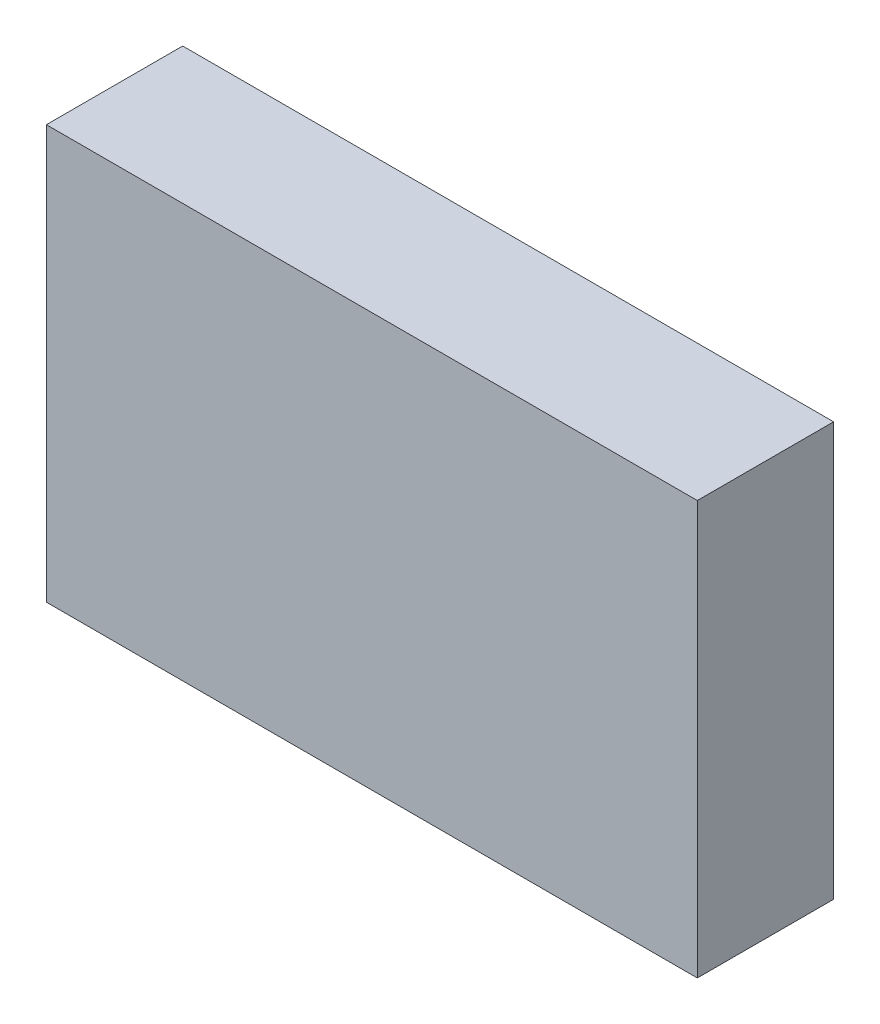
ISO-10303-21;
HEADER;
FILE_DESCRIPTION(('STEP AP214'),'2;1');
FILE_NAME('part.step','',(''),(''),'','','');
FILE_SCHEMA(('AUTOMOTIVE_DESIGN { 1 0 10303 214 1 1 1 1 }'));
ENDSEC;
DATA;
#1=APPLICATION_CONTEXT('core data for automotive mechanical design processes');
#2=APPLICATION_PROTOCOL_DEFINITION('international standard','automotive_design',2000,#1);
#3=PRODUCT_CONTEXT('',#1,'mechanical');
#4=PRODUCT('Part','Part','',(#3));
#5=PRODUCT_RELATED_PRODUCT_CATEGORY('part','',(#4));
#6=PRODUCT_DEFINITION_FORMATION('','',#4);
#7=PRODUCT_DEFINITION_CONTEXT('part definition',#1,'design');
#8=PRODUCT_DEFINITION('design','',#6,#7);
#9=PRODUCT_DEFINITION_SHAPE('','',#8);
#10=(LENGTH_UNIT() NAMED_UNIT(*) SI_UNIT(.MILLI.,.METRE.));
#11=(NAMED_UNIT(*) PLANE_ANGLE_UNIT() SI_UNIT($,.RADIAN.));
#12=(NAMED_UNIT(*) SI_UNIT($,.STERADIAN.) SOLID_ANGLE_UNIT());
#13=UNCERTAINTY_MEASURE_WITH_UNIT(LENGTH_MEASURE(1.E-05),#10,'distance_accuracy_value','');
#14=(GEOMETRIC_REPRESENTATION_CONTEXT(3) GLOBAL_UNCERTAINTY_ASSIGNED_CONTEXT((#13)) GLOBAL_UNIT_ASSIGNED_CONTEXT((#10,
#11,#12)) REPRESENTATION_CONTEXT('',''));
#15=CARTESIAN_POINT('',(0.,0.,0.));
#16=DIRECTION('',(0.,0.,1.));
#17=DIRECTION('',(1.,0.,0.));
#18=AXIS2_PLACEMENT_3D('',#15,#16,#17);
#19=CARTESIAN_POINT('',(-4.24999912,-2.69999968,1.77999898));
#20=DIRECTION('',(0.,0.,1.));
#21=DIRECTION('',(1.,0.,0.));
#22=AXIS2_PLACEMENT_3D('',#19,#20,#21);
#23=PLANE('',#22);
#24=DIRECTION('',(1.,0.,0.));
#25=VECTOR('',#24,1.);
#26=CARTESIAN_POINT('',(-4.24999912,2.69999968,1.77999898));
#27=LINE('',#26,#25);
#28=CARTESIAN_POINT('',(-4.24999912,2.69999968,1.77999898));
#29=VERTEX_POINT('',#28);
#30=CARTESIAN_POINT('',(4.24999912,2.69999968,1.77999898));
#31=VERTEX_POINT('',#30);
#32=EDGE_CURVE('E53',#29,#31,#27,.T.);
#33=ORIENTED_EDGE('',*,*,#32,.F.);
#34=DIRECTION('',(0.,1.,0.));
#35=VECTOR('',#34,1.);
#36=CARTESIAN_POINT('',(-4.24999912,-2.69999968,1.77999898));
#37=LINE('',#36,#35);
#38=CARTESIAN_POINT('',(-4.24999912,-2.69999968,1.77999898));
#39=VERTEX_POINT('',#38);
#40=EDGE_CURVE('E68',#39,#29,#37,.T.);
#41=ORIENTED_EDGE('',*,*,#40,.F.);
#42=DIRECTION('',(1.,0.,0.));
#43=VECTOR('',#42,1.);
#44=CARTESIAN_POINT('',(4.24999912,-2.69999968,1.77999898));
#45=LINE('',#44,#43);
#46=CARTESIAN_POINT('',(4.24999912,-2.69999968,1.77999898));
#47=VERTEX_POINT('',#46);
#48=EDGE_CURVE('E20',#47,#39,#45,.F.);
#49=ORIENTED_EDGE('',*,*,#48,.F.);
#50=DIRECTION('',(0.,1.,0.));
#51=VECTOR('',#50,1.);
#52=CARTESIAN_POINT('',(4.24999912,2.69999968,1.77999898));
#53=LINE('',#52,#51);
#54=EDGE_CURVE('E58',#31,#47,#53,.F.);
#55=ORIENTED_EDGE('',*,*,#54,.F.);
#56=EDGE_LOOP('',(#33,#41,#49,#55));
#57=FACE_BOUND('',#56,.T.);
#58=ADVANCED_FACE('F17',(#57),#23,.T.);
#59=CARTESIAN_POINT('',(4.24999912,-2.69999968,0.));
#60=DIRECTION('',(0.,-1.,0.));
#61=DIRECTION('',(0.,0.,-1.));
#62=AXIS2_PLACEMENT_3D('',#59,#60,#61);
#63=PLANE('',#62);
#64=DIRECTION('',(0.,0.,1.));
#65=VECTOR('',#64,1.);
#66=CARTESIAN_POINT('',(-4.24999912,-2.69999968,0.));
#67=LINE('',#66,#65);
#68=CARTESIAN_POINT('',(-4.24999912,-2.69999968,0.));
#69=VERTEX_POINT('',#68);
#70=EDGE_CURVE('E79',#69,#39,#67,.T.);
#71=ORIENTED_EDGE('',*,*,#70,.F.);
#72=DIRECTION('',(1.,0.,0.));
#73=VECTOR('',#72,1.);
#74=CARTESIAN_POINT('',(-4.24999912,-2.69999968,0.));
#75=LINE('',#74,#73);
#76=CARTESIAN_POINT('',(4.24999912,-2.69999968,0.));
#77=VERTEX_POINT('',#76);
#78=EDGE_CURVE('E74',#69,#77,#75,.T.);
#79=ORIENTED_EDGE('',*,*,#78,.T.);
#80=DIRECTION('',(0.,0.,-1.));
#81=VECTOR('',#80,1.);
#82=CARTESIAN_POINT('',(4.24999912,-2.69999968,0.));
#83=LINE('',#82,#81);
#84=EDGE_CURVE('E63',#47,#77,#83,.T.);
#85=ORIENTED_EDGE('',*,*,#84,.F.);
#86=ORIENTED_EDGE('',*,*,#48,.T.);
#87=EDGE_LOOP('',(#71,#79,#85,#86));
#88=FACE_BOUND('',#87,.T.);
#89=ADVANCED_FACE('F73',(#88),#63,.T.);
#90=CARTESIAN_POINT('',(4.24999912,2.69999968,0.));
#91=DIRECTION('',(1.,0.,0.));
#92=DIRECTION('',(0.,0.,-1.));
#93=AXIS2_PLACEMENT_3D('',#90,#91,#92);
#94=PLANE('',#93);
#95=ORIENTED_EDGE('',*,*,#84,.T.);
#96=DIRECTION('',(0.,1.,0.));
#97=VECTOR('',#96,1.);
#98=CARTESIAN_POINT('',(4.24999912,-2.69999968,0.));
#99=LINE('',#98,#97);
#100=CARTESIAN_POINT('',(4.24999912,2.69999968,0.));
#101=VERTEX_POINT('',#100);
#102=EDGE_CURVE('E84',#77,#101,#99,.T.);
#103=ORIENTED_EDGE('',*,*,#102,.T.);
#104=DIRECTION('',(0.,0.,1.));
#105=VECTOR('',#104,1.);
#106=CARTESIAN_POINT('',(4.24999912,2.69999968,0.));
#107=LINE('',#106,#105);
#108=EDGE_CURVE('E65',#31,#101,#107,.F.);
#109=ORIENTED_EDGE('',*,*,#108,.F.);
#110=ORIENTED_EDGE('',*,*,#54,.T.);
#111=EDGE_LOOP('',(#95,#103,#109,#110));
#112=FACE_BOUND('',#111,.T.);
#113=ADVANCED_FACE('F60',(#112),#94,.T.);
#114=CARTESIAN_POINT('',(-4.24999912,2.69999968,0.));
#115=DIRECTION('',(0.,1.,0.));
#116=DIRECTION('',(0.,0.,1.));
#117=AXIS2_PLACEMENT_3D('',#114,#115,#116);
#118=PLANE('',#117);
#119=ORIENTED_EDGE('',*,*,#108,.T.);
#120=DIRECTION('',(1.,0.,0.));
#121=VECTOR('',#120,1.);
#122=CARTESIAN_POINT('',(-4.24999912,2.69999968,0.));
#123=LINE('',#122,#121);
#124=CARTESIAN_POINT('',(-4.24999912,2.69999968,0.));
#125=VERTEX_POINT('',#124);
#126=EDGE_CURVE('E26',#101,#125,#123,.F.);
#127=ORIENTED_EDGE('',*,*,#126,.T.);
#128=DIRECTION('',(0.,0.,1.));
#129=VECTOR('',#128,1.);
#130=CARTESIAN_POINT('',(-4.24999912,2.69999968,0.));
#131=LINE('',#130,#129);
#132=EDGE_CURVE('E34',#29,#125,#131,.F.);
#133=ORIENTED_EDGE('',*,*,#132,.F.);
#134=ORIENTED_EDGE('',*,*,#32,.T.);
#135=EDGE_LOOP('',(#119,#127,#133,#134));
#136=FACE_BOUND('',#135,.T.);
#137=ADVANCED_FACE('F88',(#136),#118,.T.);
#138=CARTESIAN_POINT('',(-4.24999912,-2.69999968,0.));
#139=DIRECTION('',(-1.,0.,0.));
#140=DIRECTION('',(0.,0.,1.));
#141=AXIS2_PLACEMENT_3D('',#138,#139,#140);
#142=PLANE('',#141);
#143=ORIENTED_EDGE('',*,*,#132,.T.);
#144=DIRECTION('',(0.,1.,0.));
#145=VECTOR('',#144,1.);
#146=CARTESIAN_POINT('',(-4.24999912,-2.69999968,0.));
#147=LINE('',#146,#145);
#148=EDGE_CURVE('E11',#125,#69,#147,.F.);
#149=ORIENTED_EDGE('',*,*,#148,.T.);
#150=ORIENTED_EDGE('',*,*,#70,.T.);
#151=ORIENTED_EDGE('',*,*,#40,.T.);
#152=EDGE_LOOP('',(#143,#149,#150,#151));
#153=FACE_BOUND('',#152,.T.);
#154=ADVANCED_FACE('F91',(#153),#142,.T.);
#155=CARTESIAN_POINT('',(-4.24999912,-2.69999968,0.));
#156=DIRECTION('',(0.,0.,1.));
#157=DIRECTION('',(1.,0.,0.));
#158=AXIS2_PLACEMENT_3D('',#155,#156,#157);
#159=PLANE('',#158);
#160=ORIENTED_EDGE('',*,*,#126,.F.);
#161=ORIENTED_EDGE('',*,*,#102,.F.);
#162=ORIENTED_EDGE('',*,*,#78,.F.);
#163=ORIENTED_EDGE('',*,*,#148,.F.);
#164=EDGE_LOOP('',(#160,#161,#162,#163));
#165=FACE_BOUND('',#164,.T.);
#166=ADVANCED_FACE('F90',(#165),#159,.F.);
#167=CLOSED_SHELL('',(#58,#89,#113,#137,#154,#166));
#168=MANIFOLD_SOLID_BREP('B1',#167);
#169=ADVANCED_BREP_SHAPE_REPRESENTATION('',(#18,#168),#14);
#170=SHAPE_DEFINITION_REPRESENTATION(#9,#169);
ENDSEC;
END-ISO-10303-21;
